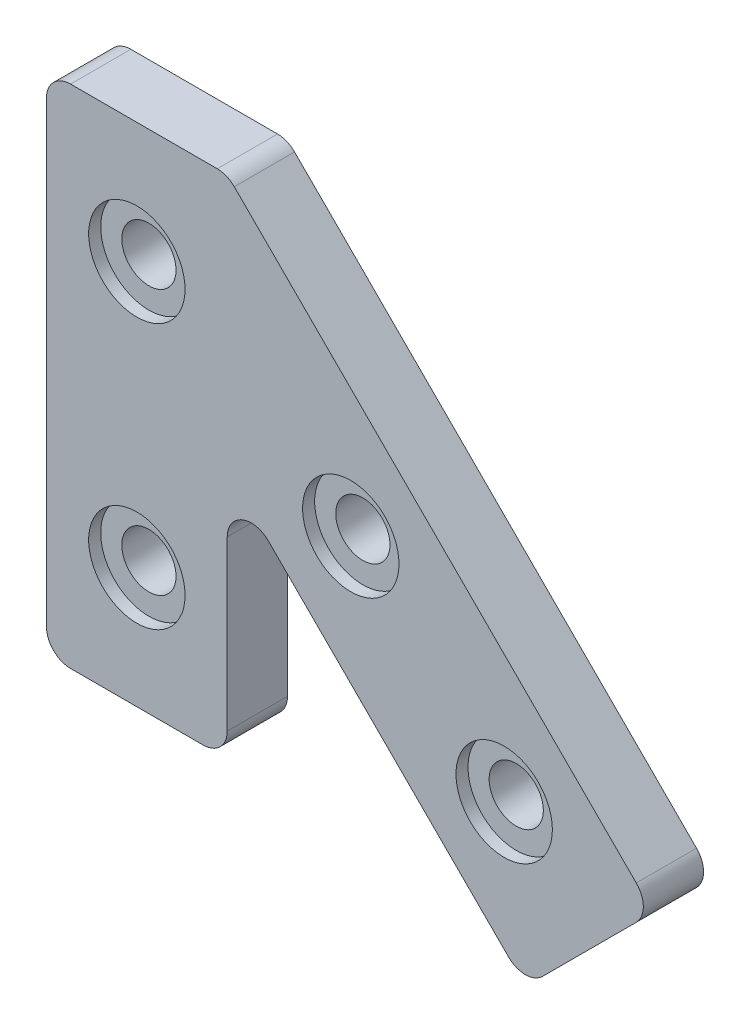
ISO-10303-21;
HEADER;
FILE_DESCRIPTION(('STEP AP214'),'2;1');
FILE_NAME('part.step','',(''),(''),'','','');
FILE_SCHEMA(('AUTOMOTIVE_DESIGN { 1 0 10303 214 1 1 1 1 }'));
ENDSEC;
DATA;
#1=APPLICATION_CONTEXT('core data for automotive mechanical design processes');
#2=APPLICATION_PROTOCOL_DEFINITION('international standard','automotive_design',2000,#1);
#3=PRODUCT_CONTEXT('',#1,'mechanical');
#4=PRODUCT('Part','Part','',(#3));
#5=PRODUCT_RELATED_PRODUCT_CATEGORY('part','',(#4));
#6=PRODUCT_DEFINITION_FORMATION('','',#4);
#7=PRODUCT_DEFINITION_CONTEXT('part definition',#1,'design');
#8=PRODUCT_DEFINITION('design','',#6,#7);
#9=PRODUCT_DEFINITION_SHAPE('','',#8);
#10=(LENGTH_UNIT() NAMED_UNIT(*) SI_UNIT(.MILLI.,.METRE.));
#11=(NAMED_UNIT(*) PLANE_ANGLE_UNIT() SI_UNIT($,.RADIAN.));
#12=(NAMED_UNIT(*) SI_UNIT($,.STERADIAN.) SOLID_ANGLE_UNIT());
#13=UNCERTAINTY_MEASURE_WITH_UNIT(LENGTH_MEASURE(1.E-05),#10,'distance_accuracy_value','');
#14=(GEOMETRIC_REPRESENTATION_CONTEXT(3) GLOBAL_UNCERTAINTY_ASSIGNED_CONTEXT((#13)) GLOBAL_UNIT_ASSIGNED_CONTEXT((#10,
#11,#12)) REPRESENTATION_CONTEXT('',''));
#15=CARTESIAN_POINT('',(0.,0.,0.));
#16=DIRECTION('',(0.,0.,1.));
#17=DIRECTION('',(1.,0.,0.));
#18=AXIS2_PLACEMENT_3D('',#15,#16,#17);
#19=CARTESIAN_POINT('',(0.,0.,5.));
#20=DIRECTION('',(0.,1.,0.));
#21=DIRECTION('',(0.,0.,1.));
#22=AXIS2_PLACEMENT_3D('',#19,#20,#21);
#23=PLANE('',#22);
#24=DIRECTION('',(1.,0.,0.));
#25=VECTOR('',#24,1.);
#26=CARTESIAN_POINT('',(0.,0.,0.));
#27=LINE('',#26,#25);
#28=CARTESIAN_POINT('',(2.,0.,0.));
#29=VERTEX_POINT('',#28);
#30=CARTESIAN_POINT('',(13.,0.,0.));
#31=VERTEX_POINT('',#30);
#32=EDGE_CURVE('E244',#29,#31,#27,.T.);
#33=ORIENTED_EDGE('',*,*,#32,.T.);
#34=DIRECTION('',(0.,0.,-1.));
#35=VECTOR('',#34,1.);
#36=CARTESIAN_POINT('',(13.,0.,5.));
#37=LINE('',#36,#35);
#38=CARTESIAN_POINT('',(13.,0.,5.));
#39=VERTEX_POINT('',#38);
#40=EDGE_CURVE('E229',#31,#39,#37,.F.);
#41=ORIENTED_EDGE('',*,*,#40,.T.);
#42=DIRECTION('',(1.,0.,0.));
#43=VECTOR('',#42,1.);
#44=CARTESIAN_POINT('',(0.,0.,5.));
#45=LINE('',#44,#43);
#46=CARTESIAN_POINT('',(2.,0.,5.));
#47=VERTEX_POINT('',#46);
#48=EDGE_CURVE('E163',#47,#39,#45,.T.);
#49=ORIENTED_EDGE('',*,*,#48,.F.);
#50=DIRECTION('',(0.,0.,-1.));
#51=VECTOR('',#50,1.);
#52=CARTESIAN_POINT('',(2.,0.,5.));
#53=LINE('',#52,#51);
#54=EDGE_CURVE('E226',#47,#29,#53,.T.);
#55=ORIENTED_EDGE('',*,*,#54,.T.);
#56=EDGE_LOOP('',(#33,#41,#49,#55));
#57=FACE_BOUND('',#56,.T.);
#58=ADVANCED_FACE('F33',(#57),#23,.F.);
#59=CARTESIAN_POINT('',(15.,0.,5.));
#60=DIRECTION('',(-1.,0.,0.));
#61=DIRECTION('',(0.,-1.,0.));
#62=AXIS2_PLACEMENT_3D('',#59,#60,#61);
#63=PLANE('',#62);
#64=DIRECTION('',(0.,1.,0.));
#65=VECTOR('',#64,1.);
#66=CARTESIAN_POINT('',(15.,0.,0.));
#67=LINE('',#66,#65);
#68=CARTESIAN_POINT('',(15.,2.,0.));
#69=VERTEX_POINT('',#68);
#70=CARTESIAN_POINT('',(15.,15.9583694396573,0.));
#71=VERTEX_POINT('',#70);
#72=EDGE_CURVE('E233',#69,#71,#67,.T.);
#73=ORIENTED_EDGE('',*,*,#72,.T.);
#74=DIRECTION('',(0.,0.,-1.));
#75=VECTOR('',#74,1.);
#76=CARTESIAN_POINT('',(15.,15.9583694396573,5.));
#77=LINE('',#76,#75);
#78=CARTESIAN_POINT('',(15.,15.9583694396573,5.));
#79=VERTEX_POINT('',#78);
#80=EDGE_CURVE('E219',#71,#79,#77,.F.);
#81=ORIENTED_EDGE('',*,*,#80,.T.);
#82=DIRECTION('',(0.,1.,0.));
#83=VECTOR('',#82,1.);
#84=CARTESIAN_POINT('',(15.,0.,5.));
#85=LINE('',#84,#83);
#86=CARTESIAN_POINT('',(15.,2.,5.));
#87=VERTEX_POINT('',#86);
#88=EDGE_CURVE('E254',#87,#79,#85,.T.);
#89=ORIENTED_EDGE('',*,*,#88,.F.);
#90=DIRECTION('',(0.,0.,-1.));
#91=VECTOR('',#90,1.);
#92=CARTESIAN_POINT('',(15.,2.,5.));
#93=LINE('',#92,#91);
#94=EDGE_CURVE('E216',#87,#69,#93,.T.);
#95=ORIENTED_EDGE('',*,*,#94,.T.);
#96=EDGE_LOOP('',(#73,#81,#89,#95));
#97=FACE_BOUND('',#96,.T.);
#98=ADVANCED_FACE('F240',(#97),#63,.F.);
#99=CARTESIAN_POINT('',(39.7487373415291,-3.96194077712562,5.));
#100=DIRECTION('',(0.707106781186549,0.707106781186547,0.));
#101=DIRECTION('',(-0.707106781186547,0.707106781186549,0.));
#102=AXIS2_PLACEMENT_3D('',#99,#100,#101);
#103=PLANE('',#102);
#104=DIRECTION('',(0.707106781186547,-0.707106781186549,0.));
#105=VECTOR('',#104,1.);
#106=CARTESIAN_POINT('',(39.7487373415291,-3.96194077712562,5.));
#107=LINE('',#106,#105);
#108=CARTESIAN_POINT('',(18.4142135623731,17.3725830020304,5.));
#109=VERTEX_POINT('',#108);
#110=CARTESIAN_POINT('',(38.334523779156,-2.54772721475253,5.));
#111=VERTEX_POINT('',#110);
#112=EDGE_CURVE('E252',#109,#111,#107,.T.);
#113=ORIENTED_EDGE('',*,*,#112,.F.);
#114=DIRECTION('',(0.,0.,-1.));
#115=VECTOR('',#114,1.);
#116=CARTESIAN_POINT('',(18.4142135623731,17.3725830020304,0.));
#117=LINE('',#116,#115);
#118=CARTESIAN_POINT('',(18.4142135623731,17.3725830020304,0.));
#119=VERTEX_POINT('',#118);
#120=EDGE_CURVE('E213',#109,#119,#117,.T.);
#121=ORIENTED_EDGE('',*,*,#120,.T.);
#122=DIRECTION('',(0.707106781186547,-0.707106781186549,0.));
#123=VECTOR('',#122,1.);
#124=CARTESIAN_POINT('',(39.7487373415291,-3.96194077712562,0.));
#125=LINE('',#124,#123);
#126=CARTESIAN_POINT('',(38.334523779156,-2.54772721475253,0.));
#127=VERTEX_POINT('',#126);
#128=EDGE_CURVE('E235',#119,#127,#125,.T.);
#129=ORIENTED_EDGE('',*,*,#128,.T.);
#130=DIRECTION('',(0.,0.,-1.));
#131=VECTOR('',#130,1.);
#132=CARTESIAN_POINT('',(38.334523779156,-2.54772721475253,5.));
#133=LINE('',#132,#131);
#134=EDGE_CURVE('E211',#127,#111,#133,.F.);
#135=ORIENTED_EDGE('',*,*,#134,.T.);
#136=EDGE_LOOP('',(#113,#121,#129,#135));
#137=FACE_BOUND('',#136,.T.);
#138=ADVANCED_FACE('F256',(#137),#103,.F.);
#139=CARTESIAN_POINT('',(50.3553390593273,6.64466094067257,5.));
#140=DIRECTION('',(-0.707106781186546,0.707106781186549,0.));
#141=DIRECTION('',(-0.707106781186549,-0.707106781186546,0.));
#142=AXIS2_PLACEMENT_3D('',#139,#140,#141);
#143=PLANE('',#142);
#144=DIRECTION('',(0.707106781186549,0.707106781186546,0.));
#145=VECTOR('',#144,1.);
#146=CARTESIAN_POINT('',(50.3553390593273,6.64466094067257,0.));
#147=LINE('',#146,#145);
#148=CARTESIAN_POINT('',(41.1629509039022,-2.54772721475253,0.));
#149=VERTEX_POINT('',#148);
#150=CARTESIAN_POINT('',(48.9411254969542,5.23044737829948,0.));
#151=VERTEX_POINT('',#150);
#152=EDGE_CURVE('E165',#149,#151,#147,.T.);
#153=ORIENTED_EDGE('',*,*,#152,.T.);
#154=DIRECTION('',(0.,0.,-1.));
#155=VECTOR('',#154,1.);
#156=CARTESIAN_POINT('',(48.9411254969542,5.23044737829948,5.));
#157=LINE('',#156,#155);
#158=CARTESIAN_POINT('',(48.9411254969542,5.23044737829948,5.));
#159=VERTEX_POINT('',#158);
#160=EDGE_CURVE('E224',#151,#159,#157,.F.);
#161=ORIENTED_EDGE('',*,*,#160,.T.);
#162=DIRECTION('',(0.707106781186549,0.707106781186546,0.));
#163=VECTOR('',#162,1.);
#164=CARTESIAN_POINT('',(50.3553390593273,6.64466094067257,5.));
#165=LINE('',#164,#163);
#166=CARTESIAN_POINT('',(41.1629509039022,-2.54772721475253,5.));
#167=VERTEX_POINT('',#166);
#168=EDGE_CURVE('E258',#167,#159,#165,.T.);
#169=ORIENTED_EDGE('',*,*,#168,.F.);
#170=DIRECTION('',(0.,0.,-1.));
#171=VECTOR('',#170,1.);
#172=CARTESIAN_POINT('',(41.1629509039022,-2.54772721475253,5.));
#173=LINE('',#172,#171);
#174=EDGE_CURVE('E221',#167,#149,#173,.T.);
#175=ORIENTED_EDGE('',*,*,#174,.T.);
#176=EDGE_LOOP('',(#153,#161,#169,#175));
#177=FACE_BOUND('',#176,.T.);
#178=ADVANCED_FACE('F276',(#177),#143,.F.);
#179=CARTESIAN_POINT('',(15.,42.,5.));
#180=DIRECTION('',(-0.707106781186549,-0.707106781186546,0.));
#181=DIRECTION('',(0.707106781186546,-0.707106781186549,0.));
#182=AXIS2_PLACEMENT_3D('',#179,#180,#181);
#183=PLANE('',#182);
#184=DIRECTION('',(-0.707106781186546,0.707106781186549,0.));
#185=VECTOR('',#184,1.);
#186=CARTESIAN_POINT('',(15.,42.,0.));
#187=LINE('',#186,#185);
#188=CARTESIAN_POINT('',(48.9411254969542,8.05887450304567,0.));
#189=VERTEX_POINT('',#188);
#190=CARTESIAN_POINT('',(15.5857864376269,41.4142135623731,0.));
#191=VERTEX_POINT('',#190);
#192=EDGE_CURVE('E161',#189,#191,#187,.T.);
#193=ORIENTED_EDGE('',*,*,#192,.T.);
#194=DIRECTION('',(0.,0.,-1.));
#195=VECTOR('',#194,1.);
#196=CARTESIAN_POINT('',(15.5857864376269,41.4142135623731,5.));
#197=LINE('',#196,#195);
#198=CARTESIAN_POINT('',(15.5857864376269,41.4142135623731,5.));
#199=VERTEX_POINT('',#198);
#200=EDGE_CURVE('E140',#191,#199,#197,.F.);
#201=ORIENTED_EDGE('',*,*,#200,.T.);
#202=DIRECTION('',(-0.707106781186546,0.707106781186549,0.));
#203=VECTOR('',#202,1.);
#204=CARTESIAN_POINT('',(15.,42.,5.));
#205=LINE('',#204,#203);
#206=CARTESIAN_POINT('',(48.9411254969542,8.05887450304567,5.));
#207=VERTEX_POINT('',#206);
#208=EDGE_CURVE('E261',#207,#199,#205,.T.);
#209=ORIENTED_EDGE('',*,*,#208,.F.);
#210=DIRECTION('',(0.,0.,-1.));
#211=VECTOR('',#210,1.);
#212=CARTESIAN_POINT('',(48.9411254969542,8.05887450304567,5.));
#213=LINE('',#212,#211);
#214=EDGE_CURVE('E145',#207,#189,#213,.T.);
#215=ORIENTED_EDGE('',*,*,#214,.T.);
#216=EDGE_LOOP('',(#193,#201,#209,#215));
#217=FACE_BOUND('',#216,.T.);
#218=ADVANCED_FACE('F285',(#217),#183,.F.);
#219=CARTESIAN_POINT('',(0.,42.,5.));
#220=DIRECTION('',(0.,-1.,0.));
#221=DIRECTION('',(0.,0.,-1.));
#222=AXIS2_PLACEMENT_3D('',#219,#220,#221);
#223=PLANE('',#222);
#224=DIRECTION('',(-1.,0.,0.));
#225=VECTOR('',#224,1.);
#226=CARTESIAN_POINT('',(0.,42.,5.));
#227=LINE('',#226,#225);
#228=CARTESIAN_POINT('',(14.1715728752538,42.,5.));
#229=VERTEX_POINT('',#228);
#230=CARTESIAN_POINT('',(2.,42.,5.));
#231=VERTEX_POINT('',#230);
#232=EDGE_CURVE('E154',#229,#231,#227,.T.);
#233=ORIENTED_EDGE('',*,*,#232,.F.);
#234=DIRECTION('',(0.,0.,-1.));
#235=VECTOR('',#234,1.);
#236=CARTESIAN_POINT('',(14.1715728752538,42.,5.));
#237=LINE('',#236,#235);
#238=CARTESIAN_POINT('',(14.1715728752538,42.,0.));
#239=VERTEX_POINT('',#238);
#240=EDGE_CURVE('E139',#229,#239,#237,.T.);
#241=ORIENTED_EDGE('',*,*,#240,.T.);
#242=DIRECTION('',(-1.,0.,0.));
#243=VECTOR('',#242,1.);
#244=CARTESIAN_POINT('',(0.,42.,0.));
#245=LINE('',#244,#243);
#246=CARTESIAN_POINT('',(2.,42.,0.));
#247=VERTEX_POINT('',#246);
#248=EDGE_CURVE('E152',#239,#247,#245,.T.);
#249=ORIENTED_EDGE('',*,*,#248,.T.);
#250=DIRECTION('',(0.,0.,-1.));
#251=VECTOR('',#250,1.);
#252=CARTESIAN_POINT('',(2.,42.,5.));
#253=LINE('',#252,#251);
#254=EDGE_CURVE('E156',#247,#231,#253,.F.);
#255=ORIENTED_EDGE('',*,*,#254,.T.);
#256=EDGE_LOOP('',(#233,#241,#249,#255));
#257=FACE_BOUND('',#256,.T.);
#258=ADVANCED_FACE('F151',(#257),#223,.F.);
#259=CARTESIAN_POINT('',(0.,0.,5.));
#260=DIRECTION('',(1.,0.,0.));
#261=DIRECTION('',(0.,0.,-1.));
#262=AXIS2_PLACEMENT_3D('',#259,#260,#261);
#263=PLANE('',#262);
#264=DIRECTION('',(0.,-1.,0.));
#265=VECTOR('',#264,1.);
#266=CARTESIAN_POINT('',(0.,0.,5.));
#267=LINE('',#266,#265);
#268=CARTESIAN_POINT('',(0.,40.,5.));
#269=VERTEX_POINT('',#268);
#270=CARTESIAN_POINT('',(0.,2.,5.));
#271=VERTEX_POINT('',#270);
#272=EDGE_CURVE('E183',#269,#271,#267,.T.);
#273=ORIENTED_EDGE('',*,*,#272,.F.);
#274=DIRECTION('',(0.,0.,-1.));
#275=VECTOR('',#274,1.);
#276=CARTESIAN_POINT('',(0.,40.,5.));
#277=LINE('',#276,#275);
#278=CARTESIAN_POINT('',(0.,40.,0.));
#279=VERTEX_POINT('',#278);
#280=EDGE_CURVE('E208',#269,#279,#277,.T.);
#281=ORIENTED_EDGE('',*,*,#280,.T.);
#282=DIRECTION('',(0.,-1.,0.));
#283=VECTOR('',#282,1.);
#284=CARTESIAN_POINT('',(0.,0.,0.));
#285=LINE('',#284,#283);
#286=CARTESIAN_POINT('',(0.,2.,0.));
#287=VERTEX_POINT('',#286);
#288=EDGE_CURVE('E160',#279,#287,#285,.T.);
#289=ORIENTED_EDGE('',*,*,#288,.T.);
#290=DIRECTION('',(0.,0.,-1.));
#291=VECTOR('',#290,1.);
#292=CARTESIAN_POINT('',(0.,2.,5.));
#293=LINE('',#292,#291);
#294=EDGE_CURVE('E48',#287,#271,#293,.F.);
#295=ORIENTED_EDGE('',*,*,#294,.T.);
#296=EDGE_LOOP('',(#273,#281,#289,#295));
#297=FACE_BOUND('',#296,.T.);
#298=ADVANCED_FACE('F292',(#297),#263,.F.);
#299=CARTESIAN_POINT('',(0.,0.,5.));
#300=DIRECTION('',(0.,0.,1.));
#301=DIRECTION('',(1.,0.,0.));
#302=AXIS2_PLACEMENT_3D('',#299,#300,#301);
#303=PLANE('',#302);
#304=CARTESIAN_POINT('',(7.5,32.,5.));
#305=DIRECTION('',(0.,0.,1.));
#306=DIRECTION('',(1.,0.,0.));
#307=AXIS2_PLACEMENT_3D('',#304,#305,#306);
#308=CIRCLE('',#307,4.);
#309=CARTESIAN_POINT('',(11.5,32.,5.));
#310=VERTEX_POINT('',#309);
#311=EDGE_CURVE('E345',#310,#310,#308,.T.);
#312=ORIENTED_EDGE('',*,*,#311,.F.);
#313=EDGE_LOOP('',(#312));
#314=FACE_BOUND('',#313,.T.);
#315=CARTESIAN_POINT('',(37.9809703885627,8.41242789363896,5.));
#316=DIRECTION('',(0.,0.,1.));
#317=DIRECTION('',(1.,0.,0.));
#318=AXIS2_PLACEMENT_3D('',#315,#316,#317);
#319=CIRCLE('',#318,4.00000000000001);
#320=CARTESIAN_POINT('',(41.9809703885627,8.41242789363896,5.));
#321=VERTEX_POINT('',#320);
#322=EDGE_CURVE('E338',#321,#321,#319,.T.);
#323=ORIENTED_EDGE('',*,*,#322,.F.);
#324=EDGE_LOOP('',(#323));
#325=FACE_BOUND('',#324,.T.);
#326=CARTESIAN_POINT('',(25.2530483272049,21.1403499549968,5.));
#327=DIRECTION('',(0.,0.,1.));
#328=DIRECTION('',(1.,0.,0.));
#329=AXIS2_PLACEMENT_3D('',#326,#327,#328);
#330=CIRCLE('',#329,4.);
#331=CARTESIAN_POINT('',(29.2530483272049,21.1403499549968,5.));
#332=VERTEX_POINT('',#331);
#333=EDGE_CURVE('E182',#332,#332,#330,.T.);
#334=ORIENTED_EDGE('',*,*,#333,.F.);
#335=EDGE_LOOP('',(#334));
#336=FACE_BOUND('',#335,.T.);
#337=CARTESIAN_POINT('',(7.5,10.,5.));
#338=DIRECTION('',(0.,0.,1.));
#339=DIRECTION('',(1.,0.,0.));
#340=AXIS2_PLACEMENT_3D('',#337,#338,#339);
#341=CIRCLE('',#340,4.);
#342=CARTESIAN_POINT('',(11.5,10.,5.));
#343=VERTEX_POINT('',#342);
#344=EDGE_CURVE('E332',#343,#343,#341,.T.);
#345=ORIENTED_EDGE('',*,*,#344,.F.);
#346=EDGE_LOOP('',(#345));
#347=FACE_BOUND('',#346,.T.);
#348=ORIENTED_EDGE('',*,*,#208,.T.);
#349=CARTESIAN_POINT('',(14.1715728752538,40.,5.));
#350=DIRECTION('',(0.,0.,1.));
#351=DIRECTION('',(1.,0.,0.));
#352=AXIS2_PLACEMENT_3D('',#349,#350,#351);
#353=CIRCLE('',#352,2.);
#354=EDGE_CURVE('E205',#199,#229,#353,.T.);
#355=ORIENTED_EDGE('',*,*,#354,.T.);
#356=ORIENTED_EDGE('',*,*,#232,.T.);
#357=CARTESIAN_POINT('',(2.,40.,5.));
#358=DIRECTION('',(0.,0.,1.));
#359=DIRECTION('',(1.,0.,0.));
#360=AXIS2_PLACEMENT_3D('',#357,#358,#359);
#361=CIRCLE('',#360,2.);
#362=EDGE_CURVE('E55',#231,#269,#361,.T.);
#363=ORIENTED_EDGE('',*,*,#362,.T.);
#364=ORIENTED_EDGE('',*,*,#272,.T.);
#365=CARTESIAN_POINT('',(2.,2.,5.));
#366=DIRECTION('',(0.,0.,1.));
#367=DIRECTION('',(1.,0.,0.));
#368=AXIS2_PLACEMENT_3D('',#365,#366,#367);
#369=CIRCLE('',#368,2.);
#370=EDGE_CURVE('E196',#271,#47,#369,.T.);
#371=ORIENTED_EDGE('',*,*,#370,.T.);
#372=ORIENTED_EDGE('',*,*,#48,.T.);
#373=CARTESIAN_POINT('',(13.,2.,5.));
#374=DIRECTION('',(0.,0.,1.));
#375=DIRECTION('',(1.,0.,0.));
#376=AXIS2_PLACEMENT_3D('',#373,#374,#375);
#377=CIRCLE('',#376,2.);
#378=EDGE_CURVE('E198',#39,#87,#377,.T.);
#379=ORIENTED_EDGE('',*,*,#378,.T.);
#380=ORIENTED_EDGE('',*,*,#88,.T.);
#381=CARTESIAN_POINT('',(17.,15.9583694396573,5.));
#382=DIRECTION('',(0.,0.,1.));
#383=DIRECTION('',(1.,0.,0.));
#384=AXIS2_PLACEMENT_3D('',#381,#382,#383);
#385=CIRCLE('',#384,2.);
#386=EDGE_CURVE('E11',#79,#109,#385,.F.);
#387=ORIENTED_EDGE('',*,*,#386,.T.);
#388=ORIENTED_EDGE('',*,*,#112,.T.);
#389=CARTESIAN_POINT('',(39.7487373415291,-1.13351365237943,5.));
#390=DIRECTION('',(0.,0.,1.));
#391=DIRECTION('',(1.,0.,0.));
#392=AXIS2_PLACEMENT_3D('',#389,#390,#391);
#393=CIRCLE('',#392,2.);
#394=EDGE_CURVE('E200',#111,#167,#393,.T.);
#395=ORIENTED_EDGE('',*,*,#394,.T.);
#396=ORIENTED_EDGE('',*,*,#168,.T.);
#397=CARTESIAN_POINT('',(47.5269119345811,6.64466094067258,5.));
#398=DIRECTION('',(0.,0.,1.));
#399=DIRECTION('',(1.,0.,0.));
#400=AXIS2_PLACEMENT_3D('',#397,#398,#399);
#401=CIRCLE('',#400,2.);
#402=EDGE_CURVE('E202',#159,#207,#401,.T.);
#403=ORIENTED_EDGE('',*,*,#402,.T.);
#404=EDGE_LOOP('',(#348,#355,#356,#363,#364,#371,#372,#379,#380,#387,#388,#395,#396,#403));
#405=FACE_BOUND('',#404,.T.);
#406=ADVANCED_FACE('F251',(#314,#325,#336,#347,#405),#303,.T.);
#407=CARTESIAN_POINT('',(0.,0.,0.));
#408=DIRECTION('',(0.,0.,1.));
#409=DIRECTION('',(1.,0.,0.));
#410=AXIS2_PLACEMENT_3D('',#407,#408,#409);
#411=PLANE('',#410);
#412=CARTESIAN_POINT('',(7.5,32.,0.));
#413=DIRECTION('',(0.,0.,1.));
#414=DIRECTION('',(1.,0.,0.));
#415=AXIS2_PLACEMENT_3D('',#412,#413,#414);
#416=CIRCLE('',#415,2.25);
#417=CARTESIAN_POINT('',(9.75,32.,0.));
#418=VERTEX_POINT('',#417);
#419=EDGE_CURVE('E179',#418,#418,#416,.T.);
#420=ORIENTED_EDGE('',*,*,#419,.T.);
#421=EDGE_LOOP('',(#420));
#422=FACE_BOUND('',#421,.T.);
#423=CARTESIAN_POINT('',(7.5,10.,0.));
#424=DIRECTION('',(0.,0.,1.));
#425=DIRECTION('',(1.,0.,0.));
#426=AXIS2_PLACEMENT_3D('',#423,#424,#425);
#427=CIRCLE('',#426,2.25);
#428=CARTESIAN_POINT('',(9.75,10.,0.));
#429=VERTEX_POINT('',#428);
#430=EDGE_CURVE('E176',#429,#429,#427,.T.);
#431=ORIENTED_EDGE('',*,*,#430,.T.);
#432=EDGE_LOOP('',(#431));
#433=FACE_BOUND('',#432,.T.);
#434=CARTESIAN_POINT('',(25.2530483272049,21.1403499549968,0.));
#435=DIRECTION('',(0.,0.,1.));
#436=DIRECTION('',(1.,0.,0.));
#437=AXIS2_PLACEMENT_3D('',#434,#435,#436);
#438=CIRCLE('',#437,2.25);
#439=CARTESIAN_POINT('',(27.5030483272049,21.1403499549968,0.));
#440=VERTEX_POINT('',#439);
#441=EDGE_CURVE('E172',#440,#440,#438,.T.);
#442=ORIENTED_EDGE('',*,*,#441,.T.);
#443=EDGE_LOOP('',(#442));
#444=FACE_BOUND('',#443,.T.);
#445=CARTESIAN_POINT('',(37.9809703885627,8.41242789363896,0.));
#446=DIRECTION('',(0.,0.,1.));
#447=DIRECTION('',(1.,0.,0.));
#448=AXIS2_PLACEMENT_3D('',#445,#446,#447);
#449=CIRCLE('',#448,2.25);
#450=CARTESIAN_POINT('',(40.2309703885627,8.41242789363896,0.));
#451=VERTEX_POINT('',#450);
#452=EDGE_CURVE('E169',#451,#451,#449,.T.);
#453=ORIENTED_EDGE('',*,*,#452,.T.);
#454=EDGE_LOOP('',(#453));
#455=FACE_BOUND('',#454,.T.);
#456=ORIENTED_EDGE('',*,*,#248,.F.);
#457=CARTESIAN_POINT('',(14.1715728752538,40.,0.));
#458=DIRECTION('',(0.,0.,1.));
#459=DIRECTION('',(1.,0.,0.));
#460=AXIS2_PLACEMENT_3D('',#457,#458,#459);
#461=CIRCLE('',#460,2.);
#462=EDGE_CURVE('E135',#239,#191,#461,.F.);
#463=ORIENTED_EDGE('',*,*,#462,.T.);
#464=ORIENTED_EDGE('',*,*,#192,.F.);
#465=CARTESIAN_POINT('',(47.5269119345811,6.64466094067258,0.));
#466=DIRECTION('',(0.,0.,1.));
#467=DIRECTION('',(1.,0.,0.));
#468=AXIS2_PLACEMENT_3D('',#465,#466,#467);
#469=CIRCLE('',#468,2.);
#470=EDGE_CURVE('E190',#189,#151,#469,.F.);
#471=ORIENTED_EDGE('',*,*,#470,.T.);
#472=ORIENTED_EDGE('',*,*,#152,.F.);
#473=CARTESIAN_POINT('',(39.7487373415291,-1.13351365237943,0.));
#474=DIRECTION('',(0.,0.,1.));
#475=DIRECTION('',(1.,0.,0.));
#476=AXIS2_PLACEMENT_3D('',#473,#474,#475);
#477=CIRCLE('',#476,2.);
#478=EDGE_CURVE('E188',#149,#127,#477,.F.);
#479=ORIENTED_EDGE('',*,*,#478,.T.);
#480=ORIENTED_EDGE('',*,*,#128,.F.);
#481=CARTESIAN_POINT('',(17.,15.9583694396573,0.));
#482=DIRECTION('',(0.,0.,1.));
#483=DIRECTION('',(1.,0.,0.));
#484=AXIS2_PLACEMENT_3D('',#481,#482,#483);
#485=CIRCLE('',#484,2.);
#486=EDGE_CURVE('E41',#119,#71,#485,.T.);
#487=ORIENTED_EDGE('',*,*,#486,.T.);
#488=ORIENTED_EDGE('',*,*,#72,.F.);
#489=CARTESIAN_POINT('',(13.,2.,0.));
#490=DIRECTION('',(0.,0.,1.));
#491=DIRECTION('',(1.,0.,0.));
#492=AXIS2_PLACEMENT_3D('',#489,#490,#491);
#493=CIRCLE('',#492,2.);
#494=EDGE_CURVE('E186',#69,#31,#493,.F.);
#495=ORIENTED_EDGE('',*,*,#494,.T.);
#496=ORIENTED_EDGE('',*,*,#32,.F.);
#497=CARTESIAN_POINT('',(2.,2.,0.));
#498=DIRECTION('',(0.,0.,1.));
#499=DIRECTION('',(1.,0.,0.));
#500=AXIS2_PLACEMENT_3D('',#497,#498,#499);
#501=CIRCLE('',#500,2.);
#502=EDGE_CURVE('E155',#29,#287,#501,.F.);
#503=ORIENTED_EDGE('',*,*,#502,.T.);
#504=ORIENTED_EDGE('',*,*,#288,.F.);
#505=CARTESIAN_POINT('',(2.,40.,0.));
#506=DIRECTION('',(0.,0.,1.));
#507=DIRECTION('',(1.,0.,0.));
#508=AXIS2_PLACEMENT_3D('',#505,#506,#507);
#509=CIRCLE('',#508,2.);
#510=EDGE_CURVE('E146',#279,#247,#509,.F.);
#511=ORIENTED_EDGE('',*,*,#510,.T.);
#512=EDGE_LOOP('',(#456,#463,#464,#471,#472,#479,#480,#487,#488,#495,#496,#503,#504,#511));
#513=FACE_BOUND('',#512,.T.);
#514=ADVANCED_FACE('F158',(#422,#433,#444,#455,#513),#411,.F.);
#515=CARTESIAN_POINT('',(7.5,10.,4.));
#516=DIRECTION('',(0.,0.,1.));
#517=DIRECTION('',(1.,0.,0.));
#518=AXIS2_PLACEMENT_3D('',#515,#516,#517);
#519=CYLINDRICAL_SURFACE('',#518,4.);
#520=CARTESIAN_POINT('',(7.5,10.,4.));
#521=DIRECTION('',(0.,0.,1.));
#522=DIRECTION('',(1.,0.,0.));
#523=AXIS2_PLACEMENT_3D('',#520,#521,#522);
#524=CIRCLE('',#523,4.);
#525=CARTESIAN_POINT('',(11.5,10.,4.));
#526=VERTEX_POINT('',#525);
#527=EDGE_CURVE('E270',#526,#526,#524,.T.);
#528=ORIENTED_EDGE('',*,*,#527,.F.);
#529=EDGE_LOOP('',(#528));
#530=FACE_BOUND('',#529,.T.);
#531=ORIENTED_EDGE('',*,*,#344,.T.);
#532=EDGE_LOOP('',(#531));
#533=FACE_BOUND('',#532,.T.);
#534=ADVANCED_FACE('F391',(#530,#533),#519,.F.);
#535=CARTESIAN_POINT('',(7.5,10.,4.));
#536=DIRECTION('',(0.,0.,1.));
#537=DIRECTION('',(1.,0.,0.));
#538=AXIS2_PLACEMENT_3D('',#535,#536,#537);
#539=PLANE('',#538);
#540=CARTESIAN_POINT('',(7.5,10.,4.));
#541=DIRECTION('',(0.,0.,1.));
#542=DIRECTION('',(1.,0.,0.));
#543=AXIS2_PLACEMENT_3D('',#540,#541,#542);
#544=CIRCLE('',#543,2.25);
#545=CARTESIAN_POINT('',(9.75,10.,4.));
#546=VERTEX_POINT('',#545);
#547=EDGE_CURVE('E360',#546,#546,#544,.T.);
#548=ORIENTED_EDGE('',*,*,#547,.F.);
#549=EDGE_LOOP('',(#548));
#550=FACE_BOUND('',#549,.T.);
#551=ORIENTED_EDGE('',*,*,#527,.T.);
#552=EDGE_LOOP('',(#551));
#553=FACE_BOUND('',#552,.T.);
#554=ADVANCED_FACE('F393',(#550,#553),#539,.T.);
#555=CARTESIAN_POINT('',(25.2530483272049,21.1403499549968,4.));
#556=DIRECTION('',(0.,0.,1.));
#557=DIRECTION('',(1.,0.,0.));
#558=AXIS2_PLACEMENT_3D('',#555,#556,#557);
#559=CYLINDRICAL_SURFACE('',#558,4.);
#560=CARTESIAN_POINT('',(25.2530483272049,21.1403499549968,4.));
#561=DIRECTION('',(0.,0.,1.));
#562=DIRECTION('',(1.,0.,0.));
#563=AXIS2_PLACEMENT_3D('',#560,#561,#562);
#564=CIRCLE('',#563,4.);
#565=CARTESIAN_POINT('',(29.2530483272049,21.1403499549968,4.));
#566=VERTEX_POINT('',#565);
#567=EDGE_CURVE('E342',#566,#566,#564,.T.);
#568=ORIENTED_EDGE('',*,*,#567,.F.);
#569=EDGE_LOOP('',(#568));
#570=FACE_BOUND('',#569,.T.);
#571=ORIENTED_EDGE('',*,*,#333,.T.);
#572=EDGE_LOOP('',(#571));
#573=FACE_BOUND('',#572,.T.);
#574=ADVANCED_FACE('F400',(#570,#573),#559,.F.);
#575=CARTESIAN_POINT('',(25.2530483272049,21.1403499549968,4.));
#576=DIRECTION('',(0.,0.,1.));
#577=DIRECTION('',(1.,0.,0.));
#578=AXIS2_PLACEMENT_3D('',#575,#576,#577);
#579=PLANE('',#578);
#580=CARTESIAN_POINT('',(25.2530483272049,21.1403499549968,4.));
#581=DIRECTION('',(0.,0.,1.));
#582=DIRECTION('',(1.,0.,0.));
#583=AXIS2_PLACEMENT_3D('',#580,#581,#582);
#584=CIRCLE('',#583,2.25);
#585=CARTESIAN_POINT('',(27.5030483272049,21.1403499549968,4.));
#586=VERTEX_POINT('',#585);
#587=EDGE_CURVE('E357',#586,#586,#584,.T.);
#588=ORIENTED_EDGE('',*,*,#587,.F.);
#589=EDGE_LOOP('',(#588));
#590=FACE_BOUND('',#589,.T.);
#591=ORIENTED_EDGE('',*,*,#567,.T.);
#592=EDGE_LOOP('',(#591));
#593=FACE_BOUND('',#592,.T.);
#594=ADVANCED_FACE('F519',(#590,#593),#579,.T.);
#595=CARTESIAN_POINT('',(37.9809703885627,8.41242789363896,4.));
#596=DIRECTION('',(0.,0.,1.));
#597=DIRECTION('',(1.,0.,0.));
#598=AXIS2_PLACEMENT_3D('',#595,#596,#597);
#599=CYLINDRICAL_SURFACE('',#598,4.00000000000001);
#600=CARTESIAN_POINT('',(37.9809703885627,8.41242789363896,4.));
#601=DIRECTION('',(0.,0.,1.));
#602=DIRECTION('',(1.,0.,0.));
#603=AXIS2_PLACEMENT_3D('',#600,#601,#602);
#604=CIRCLE('',#603,4.00000000000001);
#605=CARTESIAN_POINT('',(41.9809703885627,8.41242789363896,4.));
#606=VERTEX_POINT('',#605);
#607=EDGE_CURVE('E341',#606,#606,#604,.T.);
#608=ORIENTED_EDGE('',*,*,#607,.F.);
#609=EDGE_LOOP('',(#608));
#610=FACE_BOUND('',#609,.T.);
#611=ORIENTED_EDGE('',*,*,#322,.T.);
#612=EDGE_LOOP('',(#611));
#613=FACE_BOUND('',#612,.T.);
#614=ADVANCED_FACE('F511',(#610,#613),#599,.F.);
#615=CARTESIAN_POINT('',(37.9809703885627,8.41242789363896,4.));
#616=DIRECTION('',(0.,0.,1.));
#617=DIRECTION('',(1.,0.,0.));
#618=AXIS2_PLACEMENT_3D('',#615,#616,#617);
#619=PLANE('',#618);
#620=CARTESIAN_POINT('',(37.9809703885627,8.41242789363896,4.));
#621=DIRECTION('',(0.,0.,1.));
#622=DIRECTION('',(1.,0.,0.));
#623=AXIS2_PLACEMENT_3D('',#620,#621,#622);
#624=CIRCLE('',#623,2.25);
#625=CARTESIAN_POINT('',(40.2309703885627,8.41242789363896,4.));
#626=VERTEX_POINT('',#625);
#627=EDGE_CURVE('E354',#626,#626,#624,.T.);
#628=ORIENTED_EDGE('',*,*,#627,.F.);
#629=EDGE_LOOP('',(#628));
#630=FACE_BOUND('',#629,.T.);
#631=ORIENTED_EDGE('',*,*,#607,.T.);
#632=EDGE_LOOP('',(#631));
#633=FACE_BOUND('',#632,.T.);
#634=ADVANCED_FACE('F378',(#630,#633),#619,.T.);
#635=CARTESIAN_POINT('',(7.5,32.,4.));
#636=DIRECTION('',(0.,0.,1.));
#637=DIRECTION('',(1.,0.,0.));
#638=AXIS2_PLACEMENT_3D('',#635,#636,#637);
#639=CYLINDRICAL_SURFACE('',#638,4.);
#640=CARTESIAN_POINT('',(7.5,32.,4.));
#641=DIRECTION('',(0.,0.,1.));
#642=DIRECTION('',(1.,0.,0.));
#643=AXIS2_PLACEMENT_3D('',#640,#641,#642);
#644=CIRCLE('',#643,4.);
#645=CARTESIAN_POINT('',(11.5,32.,4.));
#646=VERTEX_POINT('',#645);
#647=EDGE_CURVE('E335',#646,#646,#644,.T.);
#648=ORIENTED_EDGE('',*,*,#647,.F.);
#649=EDGE_LOOP('',(#648));
#650=FACE_BOUND('',#649,.T.);
#651=ORIENTED_EDGE('',*,*,#311,.T.);
#652=EDGE_LOOP('',(#651));
#653=FACE_BOUND('',#652,.T.);
#654=ADVANCED_FACE('F372',(#650,#653),#639,.F.);
#655=CARTESIAN_POINT('',(7.5,32.,4.));
#656=DIRECTION('',(0.,0.,1.));
#657=DIRECTION('',(1.,0.,0.));
#658=AXIS2_PLACEMENT_3D('',#655,#656,#657);
#659=PLANE('',#658);
#660=CARTESIAN_POINT('',(7.5,32.,4.));
#661=DIRECTION('',(0.,0.,1.));
#662=DIRECTION('',(1.,0.,0.));
#663=AXIS2_PLACEMENT_3D('',#660,#661,#662);
#664=CIRCLE('',#663,2.25);
#665=CARTESIAN_POINT('',(9.75,32.,4.));
#666=VERTEX_POINT('',#665);
#667=EDGE_CURVE('E173',#666,#666,#664,.T.);
#668=ORIENTED_EDGE('',*,*,#667,.F.);
#669=EDGE_LOOP('',(#668));
#670=FACE_BOUND('',#669,.T.);
#671=ORIENTED_EDGE('',*,*,#647,.T.);
#672=EDGE_LOOP('',(#671));
#673=FACE_BOUND('',#672,.T.);
#674=ADVANCED_FACE('F368',(#670,#673),#659,.T.);
#675=CARTESIAN_POINT('',(37.9809703885627,8.41242789363896,-12.));
#676=DIRECTION('',(0.,0.,1.));
#677=DIRECTION('',(1.,0.,0.));
#678=AXIS2_PLACEMENT_3D('',#675,#676,#677);
#679=CYLINDRICAL_SURFACE('',#678,2.25);
#680=ORIENTED_EDGE('',*,*,#627,.T.);
#681=EDGE_LOOP('',(#680));
#682=FACE_BOUND('',#681,.T.);
#683=ORIENTED_EDGE('',*,*,#452,.F.);
#684=EDGE_LOOP('',(#683));
#685=FACE_BOUND('',#684,.T.);
#686=ADVANCED_FACE('F371',(#682,#685),#679,.F.);
#687=CARTESIAN_POINT('',(25.2530483272049,21.1403499549968,-12.));
#688=DIRECTION('',(0.,0.,1.));
#689=DIRECTION('',(1.,0.,0.));
#690=AXIS2_PLACEMENT_3D('',#687,#688,#689);
#691=CYLINDRICAL_SURFACE('',#690,2.25);
#692=ORIENTED_EDGE('',*,*,#587,.T.);
#693=EDGE_LOOP('',(#692));
#694=FACE_BOUND('',#693,.T.);
#695=ORIENTED_EDGE('',*,*,#441,.F.);
#696=EDGE_LOOP('',(#695));
#697=FACE_BOUND('',#696,.T.);
#698=ADVANCED_FACE('F479',(#694,#697),#691,.F.);
#699=CARTESIAN_POINT('',(7.5,10.,-12.));
#700=DIRECTION('',(0.,0.,1.));
#701=DIRECTION('',(1.,0.,0.));
#702=AXIS2_PLACEMENT_3D('',#699,#700,#701);
#703=CYLINDRICAL_SURFACE('',#702,2.25);
#704=ORIENTED_EDGE('',*,*,#547,.T.);
#705=EDGE_LOOP('',(#704));
#706=FACE_BOUND('',#705,.T.);
#707=ORIENTED_EDGE('',*,*,#430,.F.);
#708=EDGE_LOOP('',(#707));
#709=FACE_BOUND('',#708,.T.);
#710=ADVANCED_FACE('F473',(#706,#709),#703,.F.);
#711=CARTESIAN_POINT('',(7.5,32.,-12.));
#712=DIRECTION('',(0.,0.,1.));
#713=DIRECTION('',(1.,0.,0.));
#714=AXIS2_PLACEMENT_3D('',#711,#712,#713);
#715=CYLINDRICAL_SURFACE('',#714,2.25);
#716=ORIENTED_EDGE('',*,*,#667,.T.);
#717=EDGE_LOOP('',(#716));
#718=FACE_BOUND('',#717,.T.);
#719=ORIENTED_EDGE('',*,*,#419,.F.);
#720=EDGE_LOOP('',(#719));
#721=FACE_BOUND('',#720,.T.);
#722=ADVANCED_FACE('F307',(#718,#721),#715,.F.);
#723=CARTESIAN_POINT('',(14.1715728752538,40.,5.));
#724=DIRECTION('',(0.,0.,-1.));
#725=DIRECTION('',(-1.,0.,0.));
#726=AXIS2_PLACEMENT_3D('',#723,#724,#725);
#727=CYLINDRICAL_SURFACE('',#726,2.);
#728=ORIENTED_EDGE('',*,*,#354,.F.);
#729=ORIENTED_EDGE('',*,*,#200,.F.);
#730=ORIENTED_EDGE('',*,*,#462,.F.);
#731=ORIENTED_EDGE('',*,*,#240,.F.);
#732=EDGE_LOOP('',(#728,#729,#730,#731));
#733=FACE_BOUND('',#732,.T.);
#734=ADVANCED_FACE('F138',(#733),#727,.T.);
#735=CARTESIAN_POINT('',(2.,40.,5.));
#736=DIRECTION('',(0.,0.,-1.));
#737=DIRECTION('',(-1.,0.,0.));
#738=AXIS2_PLACEMENT_3D('',#735,#736,#737);
#739=CYLINDRICAL_SURFACE('',#738,2.);
#740=ORIENTED_EDGE('',*,*,#362,.F.);
#741=ORIENTED_EDGE('',*,*,#254,.F.);
#742=ORIENTED_EDGE('',*,*,#510,.F.);
#743=ORIENTED_EDGE('',*,*,#280,.F.);
#744=EDGE_LOOP('',(#740,#741,#742,#743));
#745=FACE_BOUND('',#744,.T.);
#746=ADVANCED_FACE('F306',(#745),#739,.T.);
#747=CARTESIAN_POINT('',(17.,15.9583694396573,5.));
#748=DIRECTION('',(0.,0.,1.));
#749=DIRECTION('',(1.,0.,0.));
#750=AXIS2_PLACEMENT_3D('',#747,#748,#749);
#751=CYLINDRICAL_SURFACE('',#750,2.);
#752=ORIENTED_EDGE('',*,*,#386,.F.);
#753=ORIENTED_EDGE('',*,*,#80,.F.);
#754=ORIENTED_EDGE('',*,*,#486,.F.);
#755=ORIENTED_EDGE('',*,*,#120,.F.);
#756=EDGE_LOOP('',(#752,#753,#754,#755));
#757=FACE_BOUND('',#756,.T.);
#758=ADVANCED_FACE('F247',(#757),#751,.F.);
#759=CARTESIAN_POINT('',(47.5269119345811,6.64466094067258,5.));
#760=DIRECTION('',(0.,0.,-1.));
#761=DIRECTION('',(-1.,0.,0.));
#762=AXIS2_PLACEMENT_3D('',#759,#760,#761);
#763=CYLINDRICAL_SURFACE('',#762,2.);
#764=ORIENTED_EDGE('',*,*,#402,.F.);
#765=ORIENTED_EDGE('',*,*,#160,.F.);
#766=ORIENTED_EDGE('',*,*,#470,.F.);
#767=ORIENTED_EDGE('',*,*,#214,.F.);
#768=EDGE_LOOP('',(#764,#765,#766,#767));
#769=FACE_BOUND('',#768,.T.);
#770=ADVANCED_FACE('F281',(#769),#763,.T.);
#771=CARTESIAN_POINT('',(39.7487373415291,-1.13351365237943,5.));
#772=DIRECTION('',(0.,0.,-1.));
#773=DIRECTION('',(-1.,0.,0.));
#774=AXIS2_PLACEMENT_3D('',#771,#772,#773);
#775=CYLINDRICAL_SURFACE('',#774,2.);
#776=ORIENTED_EDGE('',*,*,#394,.F.);
#777=ORIENTED_EDGE('',*,*,#134,.F.);
#778=ORIENTED_EDGE('',*,*,#478,.F.);
#779=ORIENTED_EDGE('',*,*,#174,.F.);
#780=EDGE_LOOP('',(#776,#777,#778,#779));
#781=FACE_BOUND('',#780,.T.);
#782=ADVANCED_FACE('F315',(#781),#775,.T.);
#783=CARTESIAN_POINT('',(13.,2.,5.));
#784=DIRECTION('',(0.,0.,-1.));
#785=DIRECTION('',(-1.,0.,0.));
#786=AXIS2_PLACEMENT_3D('',#783,#784,#785);
#787=CYLINDRICAL_SURFACE('',#786,2.);
#788=ORIENTED_EDGE('',*,*,#378,.F.);
#789=ORIENTED_EDGE('',*,*,#40,.F.);
#790=ORIENTED_EDGE('',*,*,#494,.F.);
#791=ORIENTED_EDGE('',*,*,#94,.F.);
#792=EDGE_LOOP('',(#788,#789,#790,#791));
#793=FACE_BOUND('',#792,.T.);
#794=ADVANCED_FACE('F317',(#793),#787,.T.);
#795=CARTESIAN_POINT('',(2.,2.,5.));
#796=DIRECTION('',(0.,0.,-1.));
#797=DIRECTION('',(-1.,0.,0.));
#798=AXIS2_PLACEMENT_3D('',#795,#796,#797);
#799=CYLINDRICAL_SURFACE('',#798,2.);
#800=ORIENTED_EDGE('',*,*,#370,.F.);
#801=ORIENTED_EDGE('',*,*,#294,.F.);
#802=ORIENTED_EDGE('',*,*,#502,.F.);
#803=ORIENTED_EDGE('',*,*,#54,.F.);
#804=EDGE_LOOP('',(#800,#801,#802,#803));
#805=FACE_BOUND('',#804,.T.);
#806=ADVANCED_FACE('F35',(#805),#799,.T.);
#807=CLOSED_SHELL('',(#58,#98,#138,#178,#218,#258,#298,#406,#514,#534,#554,#574,#594,#614,#634,
#654,#674,#686,#698,#710,#722,#734,#746,#758,#770,#782,#794,#806));
#808=MANIFOLD_SOLID_BREP('B2',#807);
#809=ADVANCED_BREP_SHAPE_REPRESENTATION('',(#18,#808),#14);
#810=SHAPE_DEFINITION_REPRESENTATION(#9,#809);
ENDSEC;
END-ISO-10303-21;
